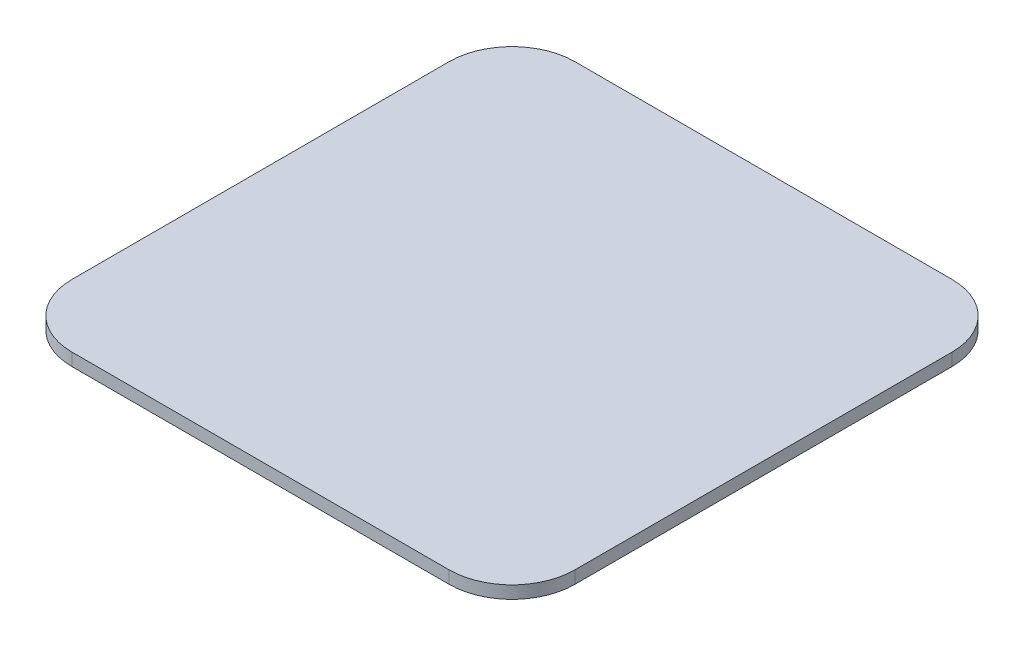
ISO-10303-21;
HEADER;
FILE_DESCRIPTION(('STEP AP214'),'2;1');
FILE_NAME('part.step','',(''),(''),'','','');
FILE_SCHEMA(('AUTOMOTIVE_DESIGN { 1 0 10303 214 1 1 1 1 }'));
ENDSEC;
DATA;
#1=APPLICATION_CONTEXT('core data for automotive mechanical design processes');
#2=APPLICATION_PROTOCOL_DEFINITION('international standard','automotive_design',2000,#1);
#3=PRODUCT_CONTEXT('',#1,'mechanical');
#4=PRODUCT('Part','Part','',(#3));
#5=PRODUCT_RELATED_PRODUCT_CATEGORY('part','',(#4));
#6=PRODUCT_DEFINITION_FORMATION('','',#4);
#7=PRODUCT_DEFINITION_CONTEXT('part definition',#1,'design');
#8=PRODUCT_DEFINITION('design','',#6,#7);
#9=PRODUCT_DEFINITION_SHAPE('','',#8);
#10=(LENGTH_UNIT() NAMED_UNIT(*) SI_UNIT(.MILLI.,.METRE.));
#11=(NAMED_UNIT(*) PLANE_ANGLE_UNIT() SI_UNIT($,.RADIAN.));
#12=(NAMED_UNIT(*) SI_UNIT($,.STERADIAN.) SOLID_ANGLE_UNIT());
#13=UNCERTAINTY_MEASURE_WITH_UNIT(LENGTH_MEASURE(1.E-05),#10,'distance_accuracy_value','');
#14=(GEOMETRIC_REPRESENTATION_CONTEXT(3) GLOBAL_UNCERTAINTY_ASSIGNED_CONTEXT((#13)) GLOBAL_UNIT_ASSIGNED_CONTEXT((#10,
#11,#12)) REPRESENTATION_CONTEXT('',''));
#15=CARTESIAN_POINT('',(0.,0.,0.));
#16=DIRECTION('',(0.,0.,1.));
#17=DIRECTION('',(1.,0.,0.));
#18=AXIS2_PLACEMENT_3D('',#15,#16,#17);
#19=CARTESIAN_POINT('',(-15.,1.,15.));
#20=DIRECTION('',(0.,-1.,0.));
#21=DIRECTION('',(0.,0.,-1.));
#22=AXIS2_PLACEMENT_3D('',#19,#20,#21);
#23=CYLINDRICAL_SURFACE('',#22,5.);
#24=CARTESIAN_POINT('',(-15.,0.,15.));
#25=DIRECTION('',(0.,1.,0.));
#26=DIRECTION('',(0.,0.,1.));
#27=AXIS2_PLACEMENT_3D('',#24,#25,#26);
#28=CIRCLE('',#27,5.);
#29=CARTESIAN_POINT('',(-20.,0.,15.));
#30=VERTEX_POINT('',#29);
#31=CARTESIAN_POINT('',(-15.,0.,20.));
#32=VERTEX_POINT('',#31);
#33=EDGE_CURVE('E140',#30,#32,#28,.T.);
#34=ORIENTED_EDGE('',*,*,#33,.T.);
#35=DIRECTION('',(0.,-1.,0.));
#36=VECTOR('',#35,1.);
#37=CARTESIAN_POINT('',(-15.,1.,20.));
#38=LINE('',#37,#36);
#39=CARTESIAN_POINT('',(-15.,1.,20.));
#40=VERTEX_POINT('',#39);
#41=EDGE_CURVE('E11',#40,#32,#38,.T.);
#42=ORIENTED_EDGE('',*,*,#41,.F.);
#43=CARTESIAN_POINT('',(-15.,1.,15.));
#44=DIRECTION('',(0.,1.,0.));
#45=DIRECTION('',(0.,0.,1.));
#46=AXIS2_PLACEMENT_3D('',#43,#44,#45);
#47=CIRCLE('',#46,5.);
#48=CARTESIAN_POINT('',(-20.,1.,15.));
#49=VERTEX_POINT('',#48);
#50=EDGE_CURVE('E162',#49,#40,#47,.T.);
#51=ORIENTED_EDGE('',*,*,#50,.F.);
#52=DIRECTION('',(0.,-1.,0.));
#53=VECTOR('',#52,1.);
#54=CARTESIAN_POINT('',(-20.,1.,15.));
#55=LINE('',#54,#53);
#56=EDGE_CURVE('E136',#49,#30,#55,.T.);
#57=ORIENTED_EDGE('',*,*,#56,.T.);
#58=EDGE_LOOP('',(#34,#42,#51,#57));
#59=FACE_BOUND('',#58,.T.);
#60=ADVANCED_FACE('F39',(#59),#23,.T.);
#61=CARTESIAN_POINT('',(-15.,1.,20.));
#62=DIRECTION('',(0.,0.,-1.));
#63=DIRECTION('',(-1.,0.,0.));
#64=AXIS2_PLACEMENT_3D('',#61,#62,#63);
#65=PLANE('',#64);
#66=DIRECTION('',(1.,0.,0.));
#67=VECTOR('',#66,1.);
#68=CARTESIAN_POINT('',(-15.,0.,20.));
#69=LINE('',#68,#67);
#70=CARTESIAN_POINT('',(15.,0.,20.));
#71=VERTEX_POINT('',#70);
#72=EDGE_CURVE('E144',#32,#71,#69,.T.);
#73=ORIENTED_EDGE('',*,*,#72,.T.);
#74=DIRECTION('',(0.,-1.,0.));
#75=VECTOR('',#74,1.);
#76=CARTESIAN_POINT('',(15.,1.,20.));
#77=LINE('',#76,#75);
#78=CARTESIAN_POINT('',(15.,1.,20.));
#79=VERTEX_POINT('',#78);
#80=EDGE_CURVE('E48',#79,#71,#77,.T.);
#81=ORIENTED_EDGE('',*,*,#80,.F.);
#82=DIRECTION('',(1.,0.,0.));
#83=VECTOR('',#82,1.);
#84=CARTESIAN_POINT('',(-15.,1.,20.));
#85=LINE('',#84,#83);
#86=EDGE_CURVE('E99',#40,#79,#85,.T.);
#87=ORIENTED_EDGE('',*,*,#86,.F.);
#88=ORIENTED_EDGE('',*,*,#41,.T.);
#89=EDGE_LOOP('',(#73,#81,#87,#88));
#90=FACE_BOUND('',#89,.T.);
#91=ADVANCED_FACE('F208',(#90),#65,.F.);
#92=CARTESIAN_POINT('',(15.,1.,15.));
#93=DIRECTION('',(0.,-1.,0.));
#94=DIRECTION('',(0.,0.,-1.));
#95=AXIS2_PLACEMENT_3D('',#92,#93,#94);
#96=CYLINDRICAL_SURFACE('',#95,5.);
#97=CARTESIAN_POINT('',(15.,0.,15.));
#98=DIRECTION('',(0.,1.,0.));
#99=DIRECTION('',(0.,0.,1.));
#100=AXIS2_PLACEMENT_3D('',#97,#98,#99);
#101=CIRCLE('',#100,5.);
#102=CARTESIAN_POINT('',(20.,0.,15.));
#103=VERTEX_POINT('',#102);
#104=EDGE_CURVE('E147',#71,#103,#101,.T.);
#105=ORIENTED_EDGE('',*,*,#104,.T.);
#106=DIRECTION('',(0.,-1.,0.));
#107=VECTOR('',#106,1.);
#108=CARTESIAN_POINT('',(20.,1.,15.));
#109=LINE('',#108,#107);
#110=CARTESIAN_POINT('',(20.,1.,15.));
#111=VERTEX_POINT('',#110);
#112=EDGE_CURVE('E173',#111,#103,#109,.T.);
#113=ORIENTED_EDGE('',*,*,#112,.F.);
#114=CARTESIAN_POINT('',(15.,1.,15.));
#115=DIRECTION('',(0.,1.,0.));
#116=DIRECTION('',(0.,0.,1.));
#117=AXIS2_PLACEMENT_3D('',#114,#115,#116);
#118=CIRCLE('',#117,5.);
#119=EDGE_CURVE('E183',#79,#111,#118,.T.);
#120=ORIENTED_EDGE('',*,*,#119,.F.);
#121=ORIENTED_EDGE('',*,*,#80,.T.);
#122=EDGE_LOOP('',(#105,#113,#120,#121));
#123=FACE_BOUND('',#122,.T.);
#124=ADVANCED_FACE('F181',(#123),#96,.T.);
#125=CARTESIAN_POINT('',(20.,1.,-15.));
#126=DIRECTION('',(-1.,0.,0.));
#127=DIRECTION('',(0.,0.,1.));
#128=AXIS2_PLACEMENT_3D('',#125,#126,#127);
#129=PLANE('',#128);
#130=DIRECTION('',(0.,0.,-1.));
#131=VECTOR('',#130,1.);
#132=CARTESIAN_POINT('',(20.,0.,-15.));
#133=LINE('',#132,#131);
#134=CARTESIAN_POINT('',(20.,0.,-15.));
#135=VERTEX_POINT('',#134);
#136=EDGE_CURVE('E150',#103,#135,#133,.T.);
#137=ORIENTED_EDGE('',*,*,#136,.T.);
#138=DIRECTION('',(0.,-1.,0.));
#139=VECTOR('',#138,1.);
#140=CARTESIAN_POINT('',(20.,1.,-15.));
#141=LINE('',#140,#139);
#142=CARTESIAN_POINT('',(20.,1.,-15.));
#143=VERTEX_POINT('',#142);
#144=EDGE_CURVE('E169',#143,#135,#141,.T.);
#145=ORIENTED_EDGE('',*,*,#144,.F.);
#146=DIRECTION('',(0.,0.,-1.));
#147=VECTOR('',#146,1.);
#148=CARTESIAN_POINT('',(20.,1.,-15.));
#149=LINE('',#148,#147);
#150=EDGE_CURVE('E196',#111,#143,#149,.T.);
#151=ORIENTED_EDGE('',*,*,#150,.F.);
#152=ORIENTED_EDGE('',*,*,#112,.T.);
#153=EDGE_LOOP('',(#137,#145,#151,#152));
#154=FACE_BOUND('',#153,.T.);
#155=ADVANCED_FACE('F191',(#154),#129,.F.);
#156=CARTESIAN_POINT('',(15.,1.,-15.));
#157=DIRECTION('',(0.,-1.,0.));
#158=DIRECTION('',(0.,0.,-1.));
#159=AXIS2_PLACEMENT_3D('',#156,#157,#158);
#160=CYLINDRICAL_SURFACE('',#159,5.);
#161=CARTESIAN_POINT('',(15.,0.,-15.));
#162=DIRECTION('',(0.,1.,0.));
#163=DIRECTION('',(0.,0.,1.));
#164=AXIS2_PLACEMENT_3D('',#161,#162,#163);
#165=CIRCLE('',#164,5.);
#166=CARTESIAN_POINT('',(15.,0.,-20.));
#167=VERTEX_POINT('',#166);
#168=EDGE_CURVE('E153',#135,#167,#165,.T.);
#169=ORIENTED_EDGE('',*,*,#168,.T.);
#170=DIRECTION('',(0.,-1.,0.));
#171=VECTOR('',#170,1.);
#172=CARTESIAN_POINT('',(15.,1.,-20.));
#173=LINE('',#172,#171);
#174=CARTESIAN_POINT('',(15.,1.,-20.));
#175=VERTEX_POINT('',#174);
#176=EDGE_CURVE('E129',#175,#167,#173,.T.);
#177=ORIENTED_EDGE('',*,*,#176,.F.);
#178=CARTESIAN_POINT('',(15.,1.,-15.));
#179=DIRECTION('',(0.,1.,0.));
#180=DIRECTION('',(0.,0.,1.));
#181=AXIS2_PLACEMENT_3D('',#178,#179,#180);
#182=CIRCLE('',#181,5.);
#183=EDGE_CURVE('E118',#143,#175,#182,.T.);
#184=ORIENTED_EDGE('',*,*,#183,.F.);
#185=ORIENTED_EDGE('',*,*,#144,.T.);
#186=EDGE_LOOP('',(#169,#177,#184,#185));
#187=FACE_BOUND('',#186,.T.);
#188=ADVANCED_FACE('F194',(#187),#160,.T.);
#189=CARTESIAN_POINT('',(-15.,1.,-20.));
#190=DIRECTION('',(0.,0.,1.));
#191=DIRECTION('',(1.,0.,0.));
#192=AXIS2_PLACEMENT_3D('',#189,#190,#191);
#193=PLANE('',#192);
#194=DIRECTION('',(-1.,0.,0.));
#195=VECTOR('',#194,1.);
#196=CARTESIAN_POINT('',(-15.,0.,-20.));
#197=LINE('',#196,#195);
#198=CARTESIAN_POINT('',(-15.,0.,-20.));
#199=VERTEX_POINT('',#198);
#200=EDGE_CURVE('E127',#167,#199,#197,.T.);
#201=ORIENTED_EDGE('',*,*,#200,.T.);
#202=DIRECTION('',(0.,-1.,0.));
#203=VECTOR('',#202,1.);
#204=CARTESIAN_POINT('',(-15.,1.,-20.));
#205=LINE('',#204,#203);
#206=CARTESIAN_POINT('',(-15.,1.,-20.));
#207=VERTEX_POINT('',#206);
#208=EDGE_CURVE('E124',#207,#199,#205,.T.);
#209=ORIENTED_EDGE('',*,*,#208,.F.);
#210=DIRECTION('',(-1.,0.,0.));
#211=VECTOR('',#210,1.);
#212=CARTESIAN_POINT('',(-15.,1.,-20.));
#213=LINE('',#212,#211);
#214=EDGE_CURVE('E112',#175,#207,#213,.T.);
#215=ORIENTED_EDGE('',*,*,#214,.F.);
#216=ORIENTED_EDGE('',*,*,#176,.T.);
#217=EDGE_LOOP('',(#201,#209,#215,#216));
#218=FACE_BOUND('',#217,.T.);
#219=ADVANCED_FACE('F125',(#218),#193,.F.);
#220=CARTESIAN_POINT('',(-15.,1.,-15.));
#221=DIRECTION('',(0.,-1.,0.));
#222=DIRECTION('',(0.,0.,-1.));
#223=AXIS2_PLACEMENT_3D('',#220,#221,#222);
#224=CYLINDRICAL_SURFACE('',#223,5.);
#225=CARTESIAN_POINT('',(-15.,0.,-15.));
#226=DIRECTION('',(0.,1.,0.));
#227=DIRECTION('',(0.,0.,-1.));
#228=AXIS2_PLACEMENT_3D('',#225,#226,#227);
#229=CIRCLE('',#228,5.);
#230=CARTESIAN_POINT('',(-20.,0.,-15.));
#231=VERTEX_POINT('',#230);
#232=EDGE_CURVE('E85',#199,#231,#229,.T.);
#233=ORIENTED_EDGE('',*,*,#232,.T.);
#234=DIRECTION('',(0.,-1.,0.));
#235=VECTOR('',#234,1.);
#236=CARTESIAN_POINT('',(-20.,1.,-15.));
#237=LINE('',#236,#235);
#238=CARTESIAN_POINT('',(-20.,1.,-15.));
#239=VERTEX_POINT('',#238);
#240=EDGE_CURVE('E130',#239,#231,#237,.T.);
#241=ORIENTED_EDGE('',*,*,#240,.F.);
#242=CARTESIAN_POINT('',(-15.,1.,-15.));
#243=DIRECTION('',(0.,1.,0.));
#244=DIRECTION('',(0.,0.,-1.));
#245=AXIS2_PLACEMENT_3D('',#242,#243,#244);
#246=CIRCLE('',#245,5.);
#247=EDGE_CURVE('E116',#207,#239,#246,.T.);
#248=ORIENTED_EDGE('',*,*,#247,.F.);
#249=ORIENTED_EDGE('',*,*,#208,.T.);
#250=EDGE_LOOP('',(#233,#241,#248,#249));
#251=FACE_BOUND('',#250,.T.);
#252=ADVANCED_FACE('F132',(#251),#224,.T.);
#253=CARTESIAN_POINT('',(-20.,1.,-15.));
#254=DIRECTION('',(1.,0.,0.));
#255=DIRECTION('',(0.,0.,-1.));
#256=AXIS2_PLACEMENT_3D('',#253,#254,#255);
#257=PLANE('',#256);
#258=DIRECTION('',(0.,0.,1.));
#259=VECTOR('',#258,1.);
#260=CARTESIAN_POINT('',(-20.,0.,-15.));
#261=LINE('',#260,#259);
#262=EDGE_CURVE('E91',#231,#30,#261,.T.);
#263=ORIENTED_EDGE('',*,*,#262,.T.);
#264=ORIENTED_EDGE('',*,*,#56,.F.);
#265=DIRECTION('',(0.,0.,1.));
#266=VECTOR('',#265,1.);
#267=CARTESIAN_POINT('',(-20.,1.,-15.));
#268=LINE('',#267,#266);
#269=EDGE_CURVE('E56',#239,#49,#268,.T.);
#270=ORIENTED_EDGE('',*,*,#269,.F.);
#271=ORIENTED_EDGE('',*,*,#240,.T.);
#272=EDGE_LOOP('',(#263,#264,#270,#271));
#273=FACE_BOUND('',#272,.T.);
#274=ADVANCED_FACE('F224',(#273),#257,.F.);
#275=CARTESIAN_POINT('',(-15.,1.,15.));
#276=DIRECTION('',(0.,1.,0.));
#277=DIRECTION('',(0.,0.,1.));
#278=AXIS2_PLACEMENT_3D('',#275,#276,#277);
#279=PLANE('',#278);
#280=ORIENTED_EDGE('',*,*,#50,.T.);
#281=ORIENTED_EDGE('',*,*,#86,.T.);
#282=ORIENTED_EDGE('',*,*,#119,.T.);
#283=ORIENTED_EDGE('',*,*,#150,.T.);
#284=ORIENTED_EDGE('',*,*,#183,.T.);
#285=ORIENTED_EDGE('',*,*,#214,.T.);
#286=ORIENTED_EDGE('',*,*,#247,.T.);
#287=ORIENTED_EDGE('',*,*,#269,.T.);
#288=EDGE_LOOP('',(#280,#281,#282,#283,#284,#285,#286,#287));
#289=FACE_BOUND('',#288,.T.);
#290=ADVANCED_FACE('F114',(#289),#279,.T.);
#291=CARTESIAN_POINT('',(-15.,0.,15.));
#292=DIRECTION('',(0.,1.,0.));
#293=DIRECTION('',(0.,0.,1.));
#294=AXIS2_PLACEMENT_3D('',#291,#292,#293);
#295=PLANE('',#294);
#296=ORIENTED_EDGE('',*,*,#33,.F.);
#297=ORIENTED_EDGE('',*,*,#262,.F.);
#298=ORIENTED_EDGE('',*,*,#232,.F.);
#299=ORIENTED_EDGE('',*,*,#200,.F.);
#300=ORIENTED_EDGE('',*,*,#168,.F.);
#301=ORIENTED_EDGE('',*,*,#136,.F.);
#302=ORIENTED_EDGE('',*,*,#104,.F.);
#303=ORIENTED_EDGE('',*,*,#72,.F.);
#304=EDGE_LOOP('',(#296,#297,#298,#299,#300,#301,#302,#303));
#305=FACE_BOUND('',#304,.T.);
#306=ADVANCED_FACE('F187',(#305),#295,.F.);
#307=CLOSED_SHELL('',(#60,#91,#124,#155,#188,#219,#252,#274,#290,#306));
#308=MANIFOLD_SOLID_BREP('B2',#307);
#309=ADVANCED_BREP_SHAPE_REPRESENTATION('',(#18,#308),#14);
#310=SHAPE_DEFINITION_REPRESENTATION(#9,#309);
ENDSEC;
END-ISO-10303-21;
